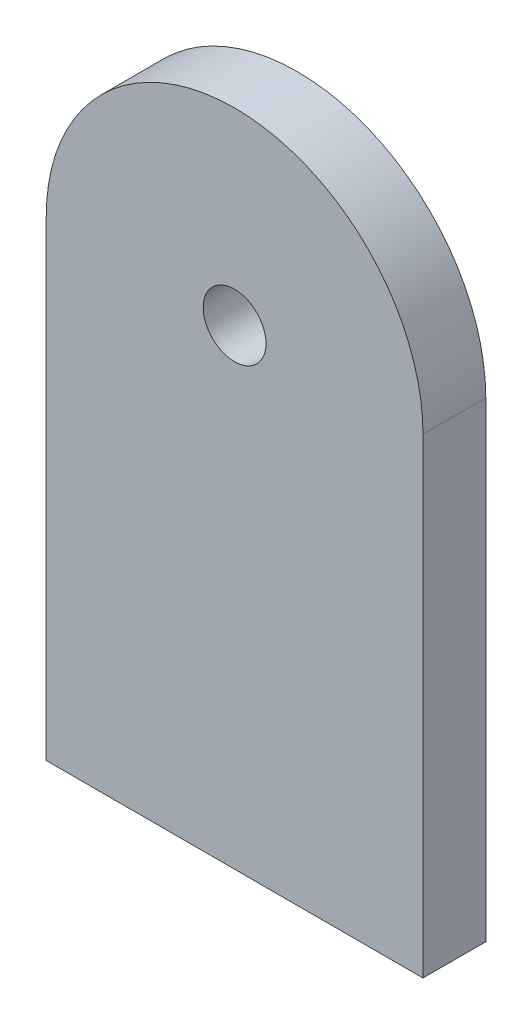
ISO-10303-21;
HEADER;
FILE_DESCRIPTION(('STEP AP214'),'2;1');
FILE_NAME('part.step','',(''),(''),'','','');
FILE_SCHEMA(('AUTOMOTIVE_DESIGN { 1 0 10303 214 1 1 1 1 }'));
ENDSEC;
DATA;
#1=APPLICATION_CONTEXT('core data for automotive mechanical design processes');
#2=APPLICATION_PROTOCOL_DEFINITION('international standard','automotive_design',2000,#1);
#3=PRODUCT_CONTEXT('',#1,'mechanical');
#4=PRODUCT('Part','Part','',(#3));
#5=PRODUCT_RELATED_PRODUCT_CATEGORY('part','',(#4));
#6=PRODUCT_DEFINITION_FORMATION('','',#4);
#7=PRODUCT_DEFINITION_CONTEXT('part definition',#1,'design');
#8=PRODUCT_DEFINITION('design','',#6,#7);
#9=PRODUCT_DEFINITION_SHAPE('','',#8);
#10=(LENGTH_UNIT() NAMED_UNIT(*) SI_UNIT(.MILLI.,.METRE.));
#11=(NAMED_UNIT(*) PLANE_ANGLE_UNIT() SI_UNIT($,.RADIAN.));
#12=(NAMED_UNIT(*) SI_UNIT($,.STERADIAN.) SOLID_ANGLE_UNIT());
#13=UNCERTAINTY_MEASURE_WITH_UNIT(LENGTH_MEASURE(1.E-05),#10,'distance_accuracy_value','');
#14=(GEOMETRIC_REPRESENTATION_CONTEXT(3) GLOBAL_UNCERTAINTY_ASSIGNED_CONTEXT((#13)) GLOBAL_UNIT_ASSIGNED_CONTEXT((#10,
#11,#12)) REPRESENTATION_CONTEXT('',''));
#15=CARTESIAN_POINT('',(0.,0.,0.));
#16=DIRECTION('',(0.,0.,1.));
#17=DIRECTION('',(1.,0.,0.));
#18=AXIS2_PLACEMENT_3D('',#15,#16,#17);
#19=CARTESIAN_POINT('',(0.,0.,10.));
#20=DIRECTION('',(0.,0.,1.));
#21=DIRECTION('',(1.,0.,0.));
#22=AXIS2_PLACEMENT_3D('',#19,#20,#21);
#23=PLANE('',#22);
#24=DIRECTION('',(0.,1.,0.));
#25=VECTOR('',#24,1.);
#26=CARTESIAN_POINT('',(30.,-75.,10.));
#27=LINE('',#26,#25);
#28=CARTESIAN_POINT('',(30.,-75.,10.));
#29=VERTEX_POINT('',#28);
#30=CARTESIAN_POINT('',(30.,0.,10.));
#31=VERTEX_POINT('',#30);
#32=EDGE_CURVE('E112',#29,#31,#27,.T.);
#33=ORIENTED_EDGE('',*,*,#32,.T.);
#34=CARTESIAN_POINT('',(0.,0.,10.));
#35=DIRECTION('',(0.,0.,1.));
#36=DIRECTION('',(1.,0.,0.));
#37=AXIS2_PLACEMENT_3D('',#34,#35,#36);
#38=CIRCLE('',#37,30.);
#39=CARTESIAN_POINT('',(-30.,0.,10.));
#40=VERTEX_POINT('',#39);
#41=EDGE_CURVE('E107',#31,#40,#38,.T.);
#42=ORIENTED_EDGE('',*,*,#41,.T.);
#43=DIRECTION('',(0.,1.,0.));
#44=VECTOR('',#43,1.);
#45=CARTESIAN_POINT('',(-30.,-75.,10.));
#46=LINE('',#45,#44);
#47=CARTESIAN_POINT('',(-30.,-75.,10.));
#48=VERTEX_POINT('',#47);
#49=EDGE_CURVE('E110',#48,#40,#46,.T.);
#50=ORIENTED_EDGE('',*,*,#49,.F.);
#51=DIRECTION('',(-1.,0.,0.));
#52=VECTOR('',#51,1.);
#53=CARTESIAN_POINT('',(9.50000000000001,-75.,10.));
#54=LINE('',#53,#52);
#55=EDGE_CURVE('E79',#29,#48,#54,.T.);
#56=ORIENTED_EDGE('',*,*,#55,.F.);
#57=EDGE_LOOP('',(#33,#42,#50,#56));
#58=FACE_BOUND('',#57,.T.);
#59=CARTESIAN_POINT('',(0.,0.,10.));
#60=DIRECTION('',(0.,0.,1.));
#61=DIRECTION('',(1.,0.,0.));
#62=AXIS2_PLACEMENT_3D('',#59,#60,#61);
#63=CIRCLE('',#62,5.);
#64=CARTESIAN_POINT('',(5.,0.,10.));
#65=VERTEX_POINT('',#64);
#66=EDGE_CURVE('E135',#65,#65,#63,.T.);
#67=ORIENTED_EDGE('',*,*,#66,.F.);
#68=EDGE_LOOP('',(#67));
#69=FACE_BOUND('',#68,.T.);
#70=ADVANCED_FACE('F61',(#58,#69),#23,.T.);
#71=CARTESIAN_POINT('',(0.,0.,0.));
#72=DIRECTION('',(0.,0.,1.));
#73=DIRECTION('',(1.,0.,0.));
#74=AXIS2_PLACEMENT_3D('',#71,#72,#73);
#75=PLANE('',#74);
#76=DIRECTION('',(0.,1.,0.));
#77=VECTOR('',#76,1.);
#78=CARTESIAN_POINT('',(30.,-75.,0.));
#79=LINE('',#78,#77);
#80=CARTESIAN_POINT('',(30.,-75.,0.));
#81=VERTEX_POINT('',#80);
#82=CARTESIAN_POINT('',(30.,0.,0.));
#83=VERTEX_POINT('',#82);
#84=EDGE_CURVE('E131',#81,#83,#79,.T.);
#85=ORIENTED_EDGE('',*,*,#84,.F.);
#86=DIRECTION('',(1.,0.,0.));
#87=VECTOR('',#86,1.);
#88=CARTESIAN_POINT('',(9.50000000000001,-75.,0.));
#89=LINE('',#88,#87);
#90=CARTESIAN_POINT('',(-30.,-75.,0.));
#91=VERTEX_POINT('',#90);
#92=EDGE_CURVE('E97',#91,#81,#89,.T.);
#93=ORIENTED_EDGE('',*,*,#92,.F.);
#94=DIRECTION('',(0.,1.,0.));
#95=VECTOR('',#94,1.);
#96=CARTESIAN_POINT('',(-30.,-75.,0.));
#97=LINE('',#96,#95);
#98=CARTESIAN_POINT('',(-30.,0.,0.));
#99=VERTEX_POINT('',#98);
#100=EDGE_CURVE('E138',#91,#99,#97,.T.);
#101=ORIENTED_EDGE('',*,*,#100,.T.);
#102=CARTESIAN_POINT('',(0.,0.,0.));
#103=DIRECTION('',(0.,0.,1.));
#104=DIRECTION('',(1.,0.,0.));
#105=AXIS2_PLACEMENT_3D('',#102,#103,#104);
#106=CIRCLE('',#105,30.);
#107=EDGE_CURVE('E118',#83,#99,#106,.T.);
#108=ORIENTED_EDGE('',*,*,#107,.F.);
#109=EDGE_LOOP('',(#85,#93,#101,#108));
#110=FACE_BOUND('',#109,.T.);
#111=CARTESIAN_POINT('',(0.,0.,0.));
#112=DIRECTION('',(0.,0.,1.));
#113=DIRECTION('',(1.,0.,0.));
#114=AXIS2_PLACEMENT_3D('',#111,#112,#113);
#115=CIRCLE('',#114,5.);
#116=CARTESIAN_POINT('',(5.,0.,0.));
#117=VERTEX_POINT('',#116);
#118=EDGE_CURVE('E152',#117,#117,#115,.T.);
#119=ORIENTED_EDGE('',*,*,#118,.T.);
#120=EDGE_LOOP('',(#119));
#121=FACE_BOUND('',#120,.T.);
#122=ADVANCED_FACE('F147',(#110,#121),#75,.F.);
#123=CARTESIAN_POINT('',(30.,-75.,10.));
#124=DIRECTION('',(-1.,0.,0.));
#125=DIRECTION('',(0.,0.,1.));
#126=AXIS2_PLACEMENT_3D('',#123,#124,#125);
#127=PLANE('',#126);
#128=ORIENTED_EDGE('',*,*,#84,.T.);
#129=DIRECTION('',(0.,0.,-1.));
#130=VECTOR('',#129,1.);
#131=CARTESIAN_POINT('',(30.,0.,10.));
#132=LINE('',#131,#130);
#133=EDGE_CURVE('E12',#31,#83,#132,.T.);
#134=ORIENTED_EDGE('',*,*,#133,.F.);
#135=ORIENTED_EDGE('',*,*,#32,.F.);
#136=DIRECTION('',(0.,0.,-1.));
#137=VECTOR('',#136,1.);
#138=CARTESIAN_POINT('',(30.,-75.,10.));
#139=LINE('',#138,#137);
#140=EDGE_CURVE('E127',#29,#81,#139,.T.);
#141=ORIENTED_EDGE('',*,*,#140,.T.);
#142=EDGE_LOOP('',(#128,#134,#135,#141));
#143=FACE_BOUND('',#142,.T.);
#144=ADVANCED_FACE('F63',(#143),#127,.F.);
#145=CARTESIAN_POINT('',(0.,0.,10.));
#146=DIRECTION('',(0.,0.,-1.));
#147=DIRECTION('',(-1.,0.,0.));
#148=AXIS2_PLACEMENT_3D('',#145,#146,#147);
#149=CYLINDRICAL_SURFACE('',#148,30.);
#150=ORIENTED_EDGE('',*,*,#107,.T.);
#151=DIRECTION('',(0.,0.,-1.));
#152=VECTOR('',#151,1.);
#153=CARTESIAN_POINT('',(-30.,0.,10.));
#154=LINE('',#153,#152);
#155=EDGE_CURVE('E71',#40,#99,#154,.T.);
#156=ORIENTED_EDGE('',*,*,#155,.F.);
#157=ORIENTED_EDGE('',*,*,#41,.F.);
#158=ORIENTED_EDGE('',*,*,#133,.T.);
#159=EDGE_LOOP('',(#150,#156,#157,#158));
#160=FACE_BOUND('',#159,.T.);
#161=ADVANCED_FACE('F117',(#160),#149,.T.);
#162=CARTESIAN_POINT('',(-30.,-75.,10.));
#163=DIRECTION('',(-1.,0.,0.));
#164=DIRECTION('',(0.,0.,1.));
#165=AXIS2_PLACEMENT_3D('',#162,#163,#164);
#166=PLANE('',#165);
#167=ORIENTED_EDGE('',*,*,#100,.F.);
#168=DIRECTION('',(0.,0.,-1.));
#169=VECTOR('',#168,1.);
#170=CARTESIAN_POINT('',(-30.,-75.,10.));
#171=LINE('',#170,#169);
#172=EDGE_CURVE('E122',#48,#91,#171,.T.);
#173=ORIENTED_EDGE('',*,*,#172,.F.);
#174=ORIENTED_EDGE('',*,*,#49,.T.);
#175=ORIENTED_EDGE('',*,*,#155,.T.);
#176=EDGE_LOOP('',(#167,#173,#174,#175));
#177=FACE_BOUND('',#176,.T.);
#178=ADVANCED_FACE('F123',(#177),#166,.T.);
#179=CARTESIAN_POINT('',(9.50000000000001,-75.,10.));
#180=DIRECTION('',(0.,1.,0.));
#181=DIRECTION('',(0.,0.,1.));
#182=AXIS2_PLACEMENT_3D('',#179,#180,#181);
#183=PLANE('',#182);
#184=ORIENTED_EDGE('',*,*,#92,.T.);
#185=ORIENTED_EDGE('',*,*,#140,.F.);
#186=ORIENTED_EDGE('',*,*,#55,.T.);
#187=ORIENTED_EDGE('',*,*,#172,.T.);
#188=EDGE_LOOP('',(#184,#185,#186,#187));
#189=FACE_BOUND('',#188,.T.);
#190=ADVANCED_FACE('F146',(#189),#183,.F.);
#191=CARTESIAN_POINT('',(0.,0.,10.));
#192=DIRECTION('',(0.,0.,-1.));
#193=DIRECTION('',(-1.,0.,0.));
#194=AXIS2_PLACEMENT_3D('',#191,#192,#193);
#195=CYLINDRICAL_SURFACE('',#194,5.);
#196=ORIENTED_EDGE('',*,*,#66,.T.);
#197=EDGE_LOOP('',(#196));
#198=FACE_BOUND('',#197,.T.);
#199=ORIENTED_EDGE('',*,*,#118,.F.);
#200=EDGE_LOOP('',(#199));
#201=FACE_BOUND('',#200,.T.);
#202=ADVANCED_FACE('F160',(#198,#201),#195,.F.);
#203=CLOSED_SHELL('',(#70,#122,#144,#161,#178,#190,#202));
#204=MANIFOLD_SOLID_BREP('B2',#203);
#205=ADVANCED_BREP_SHAPE_REPRESENTATION('',(#18,#204),#14);
#206=SHAPE_DEFINITION_REPRESENTATION(#9,#205);
ENDSEC;
END-ISO-10303-21;
